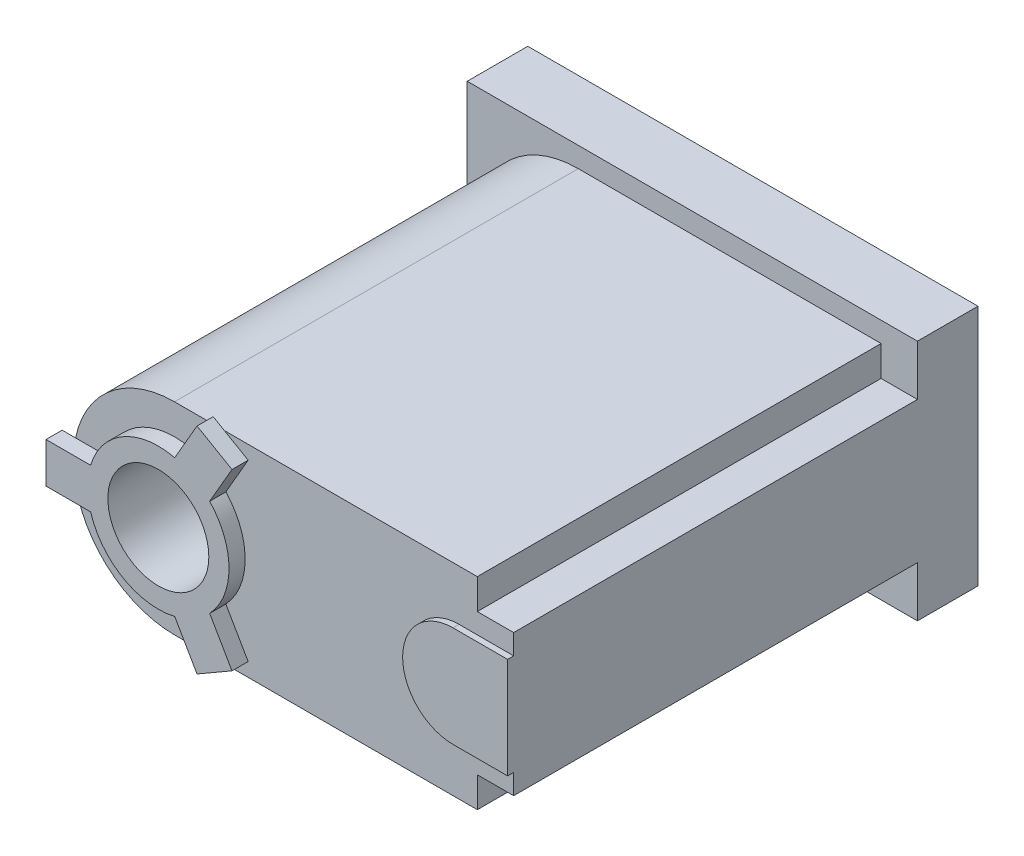
ISO-10303-21;
HEADER;
FILE_DESCRIPTION(('STEP AP214'),'2;1');
FILE_NAME('part.step','',(''),(''),'','','');
FILE_SCHEMA(('AUTOMOTIVE_DESIGN { 1 0 10303 214 1 1 1 1 }'));
ENDSEC;
DATA;
#1=APPLICATION_CONTEXT('core data for automotive mechanical design processes');
#2=APPLICATION_PROTOCOL_DEFINITION('international standard','automotive_design',2000,#1);
#3=PRODUCT_CONTEXT('',#1,'mechanical');
#4=PRODUCT('Part','Part','',(#3));
#5=PRODUCT_RELATED_PRODUCT_CATEGORY('part','',(#4));
#6=PRODUCT_DEFINITION_FORMATION('','',#4);
#7=PRODUCT_DEFINITION_CONTEXT('part definition',#1,'design');
#8=PRODUCT_DEFINITION('design','',#6,#7);
#9=PRODUCT_DEFINITION_SHAPE('','',#8);
#10=(LENGTH_UNIT() NAMED_UNIT(*) SI_UNIT(.MILLI.,.METRE.));
#11=(NAMED_UNIT(*) PLANE_ANGLE_UNIT() SI_UNIT($,.RADIAN.));
#12=(NAMED_UNIT(*) SI_UNIT($,.STERADIAN.) SOLID_ANGLE_UNIT());
#13=UNCERTAINTY_MEASURE_WITH_UNIT(LENGTH_MEASURE(1.E-05),#10,'distance_accuracy_value','');
#14=(GEOMETRIC_REPRESENTATION_CONTEXT(3) GLOBAL_UNCERTAINTY_ASSIGNED_CONTEXT((#13)) GLOBAL_UNIT_ASSIGNED_CONTEXT((#10,
#11,#12)) REPRESENTATION_CONTEXT('',''));
#15=CARTESIAN_POINT('',(0.,0.,0.));
#16=DIRECTION('',(0.,0.,1.));
#17=DIRECTION('',(1.,0.,0.));
#18=AXIS2_PLACEMENT_3D('',#15,#16,#17);
#19=CARTESIAN_POINT('',(0.,0.,230.));
#20=DIRECTION('',(0.,0.,1.));
#21=DIRECTION('',(1.,0.,0.));
#22=AXIS2_PLACEMENT_3D('',#19,#20,#21);
#23=PLANE('',#22);
#24=CARTESIAN_POINT('',(0.,0.,230.));
#25=DIRECTION('',(0.,0.,1.));
#26=DIRECTION('',(1.,0.,0.));
#27=AXIS2_PLACEMENT_3D('',#24,#25,#26);
#28=CIRCLE('',#27,35.);
#29=CARTESIAN_POINT('',(-33.5410196624969,-10.,230.));
#30=VERTEX_POINT('',#29);
#31=CARTESIAN_POINT('',(8.11025579340374,-34.0473750965557,230.));
#32=VERTEX_POINT('',#31);
#33=EDGE_CURVE('E48',#30,#32,#28,.T.);
#34=ORIENTED_EDGE('',*,*,#33,.F.);
#35=DIRECTION('',(1.,0.,0.));
#36=VECTOR('',#35,1.);
#37=CARTESIAN_POINT('',(-55.6463596710765,-10.,230.));
#38=LINE('',#37,#36);
#39=CARTESIAN_POINT('',(-48.9897948556636,-10.,230.));
#40=VERTEX_POINT('',#39);
#41=EDGE_CURVE('E447',#40,#30,#38,.T.);
#42=ORIENTED_EDGE('',*,*,#41,.F.);
#43=CARTESIAN_POINT('',(0.,0.,230.));
#44=DIRECTION('',(0.,0.,1.));
#45=DIRECTION('',(1.,0.,0.));
#46=AXIS2_PLACEMENT_3D('',#43,#44,#45);
#47=CIRCLE('',#46,50.);
#48=CARTESIAN_POINT('',(0.,-50.,230.));
#49=VERTEX_POINT('',#48);
#50=EDGE_CURVE('E392',#40,#49,#47,.T.);
#51=ORIENTED_EDGE('',*,*,#50,.T.);
#52=DIRECTION('',(1.,0.,0.));
#53=VECTOR('',#52,1.);
#54=CARTESIAN_POINT('',(150.,-50.,230.));
#55=LINE('',#54,#53);
#56=CARTESIAN_POINT('',(17.3205080756882,-50.,230.));
#57=VERTEX_POINT('',#56);
#58=EDGE_CURVE('E393',#49,#57,#55,.T.);
#59=ORIENTED_EDGE('',*,*,#58,.T.);
#60=DIRECTION('',(0.499999999999992,-0.866025403784443,0.));
#61=VECTOR('',#60,1.);
#62=CARTESIAN_POINT('',(19.1629257976934,-53.1911611032783,230.));
#63=LINE('',#62,#61);
#64=EDGE_CURVE('E53',#32,#57,#63,.T.);
#65=ORIENTED_EDGE('',*,*,#64,.F.);
#66=EDGE_LOOP('',(#34,#42,#51,#59,#65));
#67=FACE_BOUND('',#66,.T.);
#68=ADVANCED_FACE('F31',(#67),#23,.T.);
#69=DIRECTION('',(-0.499999999999992,0.866025403784443,0.));
#70=VECTOR('',#69,1.);
#71=CARTESIAN_POINT('',(36.4834338733823,-43.1911611032785,230.));
#72=LINE('',#71,#70);
#73=CARTESIAN_POINT('',(36.4834338733823,-43.1911611032785,230.));
#74=VERTEX_POINT('',#73);
#75=CARTESIAN_POINT('',(25.4307638690926,-24.0473750965559,230.));
#76=VERTEX_POINT('',#75);
#77=EDGE_CURVE('E463',#74,#76,#72,.T.);
#78=ORIENTED_EDGE('',*,*,#77,.F.);
#79=DIRECTION('',(0.866025403784443,0.499999999999992,0.));
#80=VECTOR('',#79,1.);
#81=CARTESIAN_POINT('',(19.1629257976934,-53.1911611032783,230.));
#82=LINE('',#81,#80);
#83=CARTESIAN_POINT('',(24.6901789637092,-50.,230.));
#84=VERTEX_POINT('',#83);
#85=EDGE_CURVE('E459',#84,#74,#82,.T.);
#86=ORIENTED_EDGE('',*,*,#85,.F.);
#87=CARTESIAN_POINT('',(150.,-50.,230.));
#88=VERTEX_POINT('',#87);
#89=EDGE_CURVE('E391',#84,#88,#55,.T.);
#90=ORIENTED_EDGE('',*,*,#89,.T.);
#91=DIRECTION('',(0.,1.,0.));
#92=VECTOR('',#91,1.);
#93=CARTESIAN_POINT('',(150.,50.,230.));
#94=LINE('',#93,#92);
#95=CARTESIAN_POINT('',(150.,-35.,230.));
#96=VERTEX_POINT('',#95);
#97=EDGE_CURVE('E404',#88,#96,#94,.T.);
#98=ORIENTED_EDGE('',*,*,#97,.T.);
#99=DIRECTION('',(-1.,0.,0.));
#100=VECTOR('',#99,1.);
#101=CARTESIAN_POINT('',(168.,-35.,230.));
#102=LINE('',#101,#100);
#103=CARTESIAN_POINT('',(168.,-35.,230.));
#104=VERTEX_POINT('',#103);
#105=EDGE_CURVE('E382',#104,#96,#102,.T.);
#106=ORIENTED_EDGE('',*,*,#105,.F.);
#107=DIRECTION('',(0.,-1.,0.));
#108=VECTOR('',#107,1.);
#109=CARTESIAN_POINT('',(168.,35.,230.));
#110=LINE('',#109,#108);
#111=CARTESIAN_POINT('',(168.,-25.,230.));
#112=VERTEX_POINT('',#111);
#113=EDGE_CURVE('E370',#112,#104,#110,.T.);
#114=ORIENTED_EDGE('',*,*,#113,.F.);
#115=DIRECTION('',(1.,0.,0.));
#116=VECTOR('',#115,1.);
#117=CARTESIAN_POINT('',(168.,-25.,230.));
#118=LINE('',#117,#116);
#119=CARTESIAN_POINT('',(141.,-25.,230.));
#120=VERTEX_POINT('',#119);
#121=EDGE_CURVE('E280',#120,#112,#118,.T.);
#122=ORIENTED_EDGE('',*,*,#121,.F.);
#123=CARTESIAN_POINT('',(141.,0.,230.));
#124=DIRECTION('',(0.,0.,1.));
#125=DIRECTION('',(1.,0.,0.));
#126=AXIS2_PLACEMENT_3D('',#123,#124,#125);
#127=CIRCLE('',#126,25.);
#128=CARTESIAN_POINT('',(141.,24.9999999999999,230.));
#129=VERTEX_POINT('',#128);
#130=EDGE_CURVE('E287',#129,#120,#127,.T.);
#131=ORIENTED_EDGE('',*,*,#130,.F.);
#132=DIRECTION('',(-1.,0.,0.));
#133=VECTOR('',#132,1.);
#134=CARTESIAN_POINT('',(168.,24.9999999999999,230.));
#135=LINE('',#134,#133);
#136=CARTESIAN_POINT('',(168.,24.9999999999999,230.));
#137=VERTEX_POINT('',#136);
#138=EDGE_CURVE('E275',#137,#129,#135,.T.);
#139=ORIENTED_EDGE('',*,*,#138,.F.);
#140=CARTESIAN_POINT('',(168.,35.,230.));
#141=VERTEX_POINT('',#140);
#142=EDGE_CURVE('E379',#141,#137,#110,.T.);
#143=ORIENTED_EDGE('',*,*,#142,.F.);
#144=DIRECTION('',(-1.,0.,0.));
#145=VECTOR('',#144,1.);
#146=CARTESIAN_POINT('',(168.,35.,230.));
#147=LINE('',#146,#145);
#148=CARTESIAN_POINT('',(150.,35.,230.));
#149=VERTEX_POINT('',#148);
#150=EDGE_CURVE('E584',#141,#149,#147,.T.);
#151=ORIENTED_EDGE('',*,*,#150,.T.);
#152=CARTESIAN_POINT('',(150.,50.,230.));
#153=VERTEX_POINT('',#152);
#154=EDGE_CURVE('E395',#149,#153,#94,.T.);
#155=ORIENTED_EDGE('',*,*,#154,.T.);
#156=DIRECTION('',(-1.,0.,0.));
#157=VECTOR('',#156,1.);
#158=CARTESIAN_POINT('',(0.,50.,230.));
#159=LINE('',#158,#157);
#160=CARTESIAN_POINT('',(24.6901789637093,50.,230.));
#161=VERTEX_POINT('',#160);
#162=EDGE_CURVE('E398',#153,#161,#159,.T.);
#163=ORIENTED_EDGE('',*,*,#162,.T.);
#164=DIRECTION('',(-0.866025403784436,0.500000000000004,0.));
#165=VECTOR('',#164,1.);
#166=CARTESIAN_POINT('',(36.4834338733829,43.191161103278,230.));
#167=LINE('',#166,#165);
#168=CARTESIAN_POINT('',(36.4834338733829,43.191161103278,230.));
#169=VERTEX_POINT('',#168);
#170=EDGE_CURVE('E473',#169,#161,#167,.T.);
#171=ORIENTED_EDGE('',*,*,#170,.F.);
#172=DIRECTION('',(0.500000000000004,0.866025403784436,0.));
#173=VECTOR('',#172,1.);
#174=CARTESIAN_POINT('',(36.4834338733829,43.191161103278,230.));
#175=LINE('',#174,#173);
#176=CARTESIAN_POINT('',(25.4307638690929,24.0473750965555,230.));
#177=VERTEX_POINT('',#176);
#178=EDGE_CURVE('E469',#177,#169,#175,.T.);
#179=ORIENTED_EDGE('',*,*,#178,.F.);
#180=CARTESIAN_POINT('',(0.,0.,230.));
#181=DIRECTION('',(0.,0.,1.));
#182=DIRECTION('',(1.,0.,0.));
#183=AXIS2_PLACEMENT_3D('',#180,#181,#182);
#184=CIRCLE('',#183,35.);
#185=EDGE_CURVE('E466',#76,#177,#184,.T.);
#186=ORIENTED_EDGE('',*,*,#185,.F.);
#187=EDGE_LOOP('',(#78,#86,#90,#98,#106,#114,#122,#131,#139,#143,#151,#155,#163,#171,#179,#186));
#188=FACE_BOUND('',#187,.T.);
#189=ADVANCED_FACE('F538',(#188),#23,.T.);
#190=CARTESIAN_POINT('',(0.,50.,230.));
#191=VERTEX_POINT('',#190);
#192=CARTESIAN_POINT('',(-48.9897948556636,10.,230.));
#193=VERTEX_POINT('',#192);
#194=EDGE_CURVE('E388',#191,#193,#47,.T.);
#195=ORIENTED_EDGE('',*,*,#194,.T.);
#196=DIRECTION('',(-1.,0.,0.));
#197=VECTOR('',#196,1.);
#198=CARTESIAN_POINT('',(-55.6463596710765,10.,230.));
#199=LINE('',#198,#197);
#200=CARTESIAN_POINT('',(-33.5410196624969,10.,230.));
#201=VERTEX_POINT('',#200);
#202=EDGE_CURVE('E526',#201,#193,#199,.T.);
#203=ORIENTED_EDGE('',*,*,#202,.F.);
#204=CARTESIAN_POINT('',(0.,0.,230.));
#205=DIRECTION('',(0.,0.,1.));
#206=DIRECTION('',(1.,0.,0.));
#207=AXIS2_PLACEMENT_3D('',#204,#205,#206);
#208=CIRCLE('',#207,35.);
#209=CARTESIAN_POINT('',(8.1102557934042,34.0473750965556,230.));
#210=VERTEX_POINT('',#209);
#211=EDGE_CURVE('E260',#210,#201,#208,.T.);
#212=ORIENTED_EDGE('',*,*,#211,.F.);
#213=DIRECTION('',(-0.500000000000004,-0.866025403784436,0.));
#214=VECTOR('',#213,1.);
#215=CARTESIAN_POINT('',(19.1629257976941,53.1911611032781,230.));
#216=LINE('',#215,#214);
#217=CARTESIAN_POINT('',(17.320508075689,50.,230.));
#218=VERTEX_POINT('',#217);
#219=EDGE_CURVE('E430',#218,#210,#216,.T.);
#220=ORIENTED_EDGE('',*,*,#219,.F.);
#221=EDGE_CURVE('E407',#218,#191,#159,.T.);
#222=ORIENTED_EDGE('',*,*,#221,.T.);
#223=EDGE_LOOP('',(#195,#203,#212,#220,#222));
#224=FACE_BOUND('',#223,.T.);
#225=ADVANCED_FACE('F427',(#224),#23,.T.);
#226=CARTESIAN_POINT('',(150.,50.,230.));
#227=DIRECTION('',(-1.,0.,0.));
#228=DIRECTION('',(0.,0.,1.));
#229=AXIS2_PLACEMENT_3D('',#226,#227,#228);
#230=PLANE('',#229);
#231=DIRECTION('',(0.,0.,-1.));
#232=VECTOR('',#231,1.);
#233=CARTESIAN_POINT('',(150.,-50.,230.));
#234=LINE('',#233,#232);
#235=CARTESIAN_POINT('',(150.,-50.,30.));
#236=VERTEX_POINT('',#235);
#237=EDGE_CURVE('E410',#88,#236,#234,.T.);
#238=ORIENTED_EDGE('',*,*,#237,.T.);
#239=DIRECTION('',(0.,1.,0.));
#240=VECTOR('',#239,1.);
#241=CARTESIAN_POINT('',(150.,50.,30.));
#242=LINE('',#241,#240);
#243=CARTESIAN_POINT('',(150.,-35.,30.));
#244=VERTEX_POINT('',#243);
#245=EDGE_CURVE('E357',#236,#244,#242,.T.);
#246=ORIENTED_EDGE('',*,*,#245,.T.);
#247=DIRECTION('',(0.,0.,-1.));
#248=VECTOR('',#247,1.);
#249=CARTESIAN_POINT('',(150.,-35.,230.));
#250=LINE('',#249,#248);
#251=EDGE_CURVE('E360',#96,#244,#250,.T.);
#252=ORIENTED_EDGE('',*,*,#251,.F.);
#253=ORIENTED_EDGE('',*,*,#97,.F.);
#254=EDGE_LOOP('',(#238,#246,#252,#253));
#255=FACE_BOUND('',#254,.T.);
#256=ADVANCED_FACE('F546',(#255),#230,.F.);
#257=DIRECTION('',(0.,0.,1.));
#258=VECTOR('',#257,1.);
#259=CARTESIAN_POINT('',(150.,35.,0.));
#260=LINE('',#259,#258);
#261=CARTESIAN_POINT('',(150.,35.,30.));
#262=VERTEX_POINT('',#261);
#263=EDGE_CURVE('E366',#262,#149,#260,.T.);
#264=ORIENTED_EDGE('',*,*,#263,.F.);
#265=DIRECTION('',(0.,1.,0.));
#266=VECTOR('',#265,1.);
#267=CARTESIAN_POINT('',(150.,50.,30.));
#268=LINE('',#267,#266);
#269=CARTESIAN_POINT('',(150.,50.,30.));
#270=VERTEX_POINT('',#269);
#271=EDGE_CURVE('E349',#262,#270,#268,.T.);
#272=ORIENTED_EDGE('',*,*,#271,.T.);
#273=DIRECTION('',(0.,0.,-1.));
#274=VECTOR('',#273,1.);
#275=CARTESIAN_POINT('',(150.,50.,230.));
#276=LINE('',#275,#274);
#277=EDGE_CURVE('E413',#153,#270,#276,.T.);
#278=ORIENTED_EDGE('',*,*,#277,.F.);
#279=ORIENTED_EDGE('',*,*,#154,.F.);
#280=EDGE_LOOP('',(#264,#272,#278,#279));
#281=FACE_BOUND('',#280,.T.);
#282=ADVANCED_FACE('F550',(#281),#230,.F.);
#283=CARTESIAN_POINT('',(0.,0.,0.));
#284=DIRECTION('',(0.,0.,1.));
#285=DIRECTION('',(1.,0.,0.));
#286=AXIS2_PLACEMENT_3D('',#283,#284,#285);
#287=PLANE('',#286);
#288=DIRECTION('',(0.,1.,0.));
#289=VECTOR('',#288,1.);
#290=CARTESIAN_POINT('',(168.,-35.,0.));
#291=LINE('',#290,#289);
#292=CARTESIAN_POINT('',(168.,-60.,0.));
#293=VERTEX_POINT('',#292);
#294=CARTESIAN_POINT('',(168.,60.,0.));
#295=VERTEX_POINT('',#294);
#296=EDGE_CURVE('E365',#293,#295,#291,.T.);
#297=ORIENTED_EDGE('',*,*,#296,.F.);
#298=DIRECTION('',(-1.,0.,0.));
#299=VECTOR('',#298,1.);
#300=CARTESIAN_POINT('',(-55.,-60.,0.));
#301=LINE('',#300,#299);
#302=CARTESIAN_POINT('',(-55.,-60.,0.));
#303=VERTEX_POINT('',#302);
#304=EDGE_CURVE('E314',#293,#303,#301,.T.);
#305=ORIENTED_EDGE('',*,*,#304,.T.);
#306=DIRECTION('',(0.,1.,0.));
#307=VECTOR('',#306,1.);
#308=CARTESIAN_POINT('',(-55.,60.,0.));
#309=LINE('',#308,#307);
#310=CARTESIAN_POINT('',(-55.,60.,0.));
#311=VERTEX_POINT('',#310);
#312=EDGE_CURVE('E333',#303,#311,#309,.T.);
#313=ORIENTED_EDGE('',*,*,#312,.T.);
#314=DIRECTION('',(1.,0.,0.));
#315=VECTOR('',#314,1.);
#316=CARTESIAN_POINT('',(168.,60.,0.));
#317=LINE('',#316,#315);
#318=EDGE_CURVE('E320',#311,#295,#317,.T.);
#319=ORIENTED_EDGE('',*,*,#318,.T.);
#320=EDGE_LOOP('',(#297,#305,#313,#319));
#321=FACE_BOUND('',#320,.T.);
#322=ADVANCED_FACE('F556',(#321),#287,.F.);
#323=CARTESIAN_POINT('',(0.,0.,230.));
#324=DIRECTION('',(0.,0.,-1.));
#325=DIRECTION('',(-1.,0.,0.));
#326=AXIS2_PLACEMENT_3D('',#323,#324,#325);
#327=CYLINDRICAL_SURFACE('',#326,50.);
#328=DIRECTION('',(0.,0.,-1.));
#329=VECTOR('',#328,1.);
#330=CARTESIAN_POINT('',(0.,50.,230.));
#331=LINE('',#330,#329);
#332=CARTESIAN_POINT('',(0.,50.,30.));
#333=VERTEX_POINT('',#332);
#334=EDGE_CURVE('E415',#191,#333,#331,.T.);
#335=ORIENTED_EDGE('',*,*,#334,.T.);
#336=CARTESIAN_POINT('',(0.,0.,30.));
#337=DIRECTION('',(0.,0.,1.));
#338=DIRECTION('',(1.,0.,0.));
#339=AXIS2_PLACEMENT_3D('',#336,#337,#338);
#340=CIRCLE('',#339,50.);
#341=CARTESIAN_POINT('',(0.,-50.,30.));
#342=VERTEX_POINT('',#341);
#343=EDGE_CURVE('E353',#333,#342,#340,.T.);
#344=ORIENTED_EDGE('',*,*,#343,.T.);
#345=DIRECTION('',(0.,0.,-1.));
#346=VECTOR('',#345,1.);
#347=CARTESIAN_POINT('',(0.,-50.,230.));
#348=LINE('',#347,#346);
#349=EDGE_CURVE('E40',#49,#342,#348,.T.);
#350=ORIENTED_EDGE('',*,*,#349,.F.);
#351=ORIENTED_EDGE('',*,*,#50,.F.);
#352=CARTESIAN_POINT('',(0.,0.,230.));
#353=DIRECTION('',(0.,0.,1.));
#354=DIRECTION('',(1.,0.,0.));
#355=AXIS2_PLACEMENT_3D('',#352,#353,#354);
#356=CIRCLE('',#355,50.);
#357=EDGE_CURVE('E272',#193,#40,#356,.T.);
#358=ORIENTED_EDGE('',*,*,#357,.F.);
#359=ORIENTED_EDGE('',*,*,#194,.F.);
#360=EDGE_LOOP('',(#335,#344,#350,#351,#358,#359));
#361=FACE_BOUND('',#360,.T.);
#362=ADVANCED_FACE('F33',(#361),#327,.T.);
#363=CARTESIAN_POINT('',(150.,-50.,230.));
#364=DIRECTION('',(0.,1.,0.));
#365=DIRECTION('',(-1.,0.,0.));
#366=AXIS2_PLACEMENT_3D('',#363,#364,#365);
#367=PLANE('',#366);
#368=ORIENTED_EDGE('',*,*,#349,.T.);
#369=DIRECTION('',(1.,0.,0.));
#370=VECTOR('',#369,1.);
#371=CARTESIAN_POINT('',(150.,-50.,30.));
#372=LINE('',#371,#370);
#373=EDGE_CURVE('E355',#342,#236,#372,.T.);
#374=ORIENTED_EDGE('',*,*,#373,.T.);
#375=ORIENTED_EDGE('',*,*,#237,.F.);
#376=ORIENTED_EDGE('',*,*,#89,.F.);
#377=DIRECTION('',(1.,0.,0.));
#378=VECTOR('',#377,1.);
#379=CARTESIAN_POINT('',(150.,-50.,230.));
#380=LINE('',#379,#378);
#381=EDGE_CURVE('E264',#57,#84,#380,.T.);
#382=ORIENTED_EDGE('',*,*,#381,.F.);
#383=ORIENTED_EDGE('',*,*,#58,.F.);
#384=EDGE_LOOP('',(#368,#374,#375,#376,#382,#383));
#385=FACE_BOUND('',#384,.T.);
#386=ADVANCED_FACE('F559',(#385),#367,.F.);
#387=CARTESIAN_POINT('',(0.,50.,230.));
#388=DIRECTION('',(0.,-1.,0.));
#389=DIRECTION('',(1.,0.,0.));
#390=AXIS2_PLACEMENT_3D('',#387,#388,#389);
#391=PLANE('',#390);
#392=ORIENTED_EDGE('',*,*,#277,.T.);
#393=DIRECTION('',(-1.,0.,0.));
#394=VECTOR('',#393,1.);
#395=CARTESIAN_POINT('',(0.,50.,30.));
#396=LINE('',#395,#394);
#397=EDGE_CURVE('E351',#270,#333,#396,.T.);
#398=ORIENTED_EDGE('',*,*,#397,.T.);
#399=ORIENTED_EDGE('',*,*,#334,.F.);
#400=ORIENTED_EDGE('',*,*,#221,.F.);
#401=DIRECTION('',(-1.,0.,0.));
#402=VECTOR('',#401,1.);
#403=CARTESIAN_POINT('',(0.,50.,230.));
#404=LINE('',#403,#402);
#405=EDGE_CURVE('E261',#161,#218,#404,.T.);
#406=ORIENTED_EDGE('',*,*,#405,.F.);
#407=ORIENTED_EDGE('',*,*,#162,.F.);
#408=EDGE_LOOP('',(#392,#398,#399,#400,#406,#407));
#409=FACE_BOUND('',#408,.T.);
#410=ADVANCED_FACE('F432',(#409),#391,.F.);
#411=CARTESIAN_POINT('',(168.,-35.,230.));
#412=DIRECTION('',(0.,1.,0.));
#413=DIRECTION('',(0.,0.,1.));
#414=AXIS2_PLACEMENT_3D('',#411,#412,#413);
#415=PLANE('',#414);
#416=ORIENTED_EDGE('',*,*,#251,.T.);
#417=DIRECTION('',(1.,0.,0.));
#418=VECTOR('',#417,1.);
#419=CARTESIAN_POINT('',(168.,-35.,30.));
#420=LINE('',#419,#418);
#421=CARTESIAN_POINT('',(168.,-35.,30.));
#422=VERTEX_POINT('',#421);
#423=EDGE_CURVE('E359',#244,#422,#420,.T.);
#424=ORIENTED_EDGE('',*,*,#423,.T.);
#425=DIRECTION('',(0.,0.,-1.));
#426=VECTOR('',#425,1.);
#427=CARTESIAN_POINT('',(168.,-35.,230.));
#428=LINE('',#427,#426);
#429=EDGE_CURVE('E362',#104,#422,#428,.T.);
#430=ORIENTED_EDGE('',*,*,#429,.F.);
#431=ORIENTED_EDGE('',*,*,#105,.T.);
#432=EDGE_LOOP('',(#416,#424,#430,#431));
#433=FACE_BOUND('',#432,.T.);
#434=ADVANCED_FACE('F566',(#433),#415,.F.);
#435=CARTESIAN_POINT('',(168.,35.,0.));
#436=DIRECTION('',(0.,-1.,0.));
#437=DIRECTION('',(0.,0.,-1.));
#438=AXIS2_PLACEMENT_3D('',#435,#436,#437);
#439=PLANE('',#438);
#440=DIRECTION('',(0.,0.,1.));
#441=VECTOR('',#440,1.);
#442=CARTESIAN_POINT('',(168.,35.,0.));
#443=LINE('',#442,#441);
#444=CARTESIAN_POINT('',(168.,35.,30.));
#445=VERTEX_POINT('',#444);
#446=EDGE_CURVE('E368',#445,#141,#443,.T.);
#447=ORIENTED_EDGE('',*,*,#446,.F.);
#448=DIRECTION('',(-1.,0.,0.));
#449=VECTOR('',#448,1.);
#450=CARTESIAN_POINT('',(168.,35.,30.));
#451=LINE('',#450,#449);
#452=EDGE_CURVE('E341',#445,#262,#451,.T.);
#453=ORIENTED_EDGE('',*,*,#452,.T.);
#454=ORIENTED_EDGE('',*,*,#263,.T.);
#455=ORIENTED_EDGE('',*,*,#150,.F.);
#456=EDGE_LOOP('',(#447,#453,#454,#455));
#457=FACE_BOUND('',#456,.T.);
#458=ADVANCED_FACE('F629',(#457),#439,.F.);
#459=CARTESIAN_POINT('',(168.,-35.,0.));
#460=DIRECTION('',(1.,0.,0.));
#461=DIRECTION('',(0.,0.,-1.));
#462=AXIS2_PLACEMENT_3D('',#459,#460,#461);
#463=PLANE('',#462);
#464=ORIENTED_EDGE('',*,*,#429,.T.);
#465=DIRECTION('',(0.,-1.,0.));
#466=VECTOR('',#465,1.);
#467=CARTESIAN_POINT('',(168.,-60.,30.));
#468=LINE('',#467,#466);
#469=CARTESIAN_POINT('',(168.,-60.,30.));
#470=VERTEX_POINT('',#469);
#471=EDGE_CURVE('E326',#422,#470,#468,.T.);
#472=ORIENTED_EDGE('',*,*,#471,.T.);
#473=DIRECTION('',(0.,0.,-1.));
#474=VECTOR('',#473,1.);
#475=CARTESIAN_POINT('',(168.,-60.,30.));
#476=LINE('',#475,#474);
#477=EDGE_CURVE('E338',#470,#293,#476,.T.);
#478=ORIENTED_EDGE('',*,*,#477,.T.);
#479=ORIENTED_EDGE('',*,*,#296,.T.);
#480=DIRECTION('',(0.,0.,-1.));
#481=VECTOR('',#480,1.);
#482=CARTESIAN_POINT('',(168.,60.,30.));
#483=LINE('',#482,#481);
#484=CARTESIAN_POINT('',(168.,60.,30.));
#485=VERTEX_POINT('',#484);
#486=EDGE_CURVE('E342',#485,#295,#483,.T.);
#487=ORIENTED_EDGE('',*,*,#486,.F.);
#488=EDGE_CURVE('E327',#485,#445,#468,.T.);
#489=ORIENTED_EDGE('',*,*,#488,.T.);
#490=ORIENTED_EDGE('',*,*,#446,.T.);
#491=ORIENTED_EDGE('',*,*,#142,.T.);
#492=DIRECTION('',(0.,0.,-1.));
#493=VECTOR('',#492,1.);
#494=CARTESIAN_POINT('',(168.,24.9999999999999,233.));
#495=LINE('',#494,#493);
#496=CARTESIAN_POINT('',(168.,24.9999999999999,233.));
#497=VERTEX_POINT('',#496);
#498=EDGE_CURVE('E309',#497,#137,#495,.T.);
#499=ORIENTED_EDGE('',*,*,#498,.F.);
#500=DIRECTION('',(0.,1.,0.));
#501=VECTOR('',#500,1.);
#502=CARTESIAN_POINT('',(168.,24.9999999999999,233.));
#503=LINE('',#502,#501);
#504=CARTESIAN_POINT('',(168.,-25.,233.));
#505=VERTEX_POINT('',#504);
#506=EDGE_CURVE('E276',#505,#497,#503,.T.);
#507=ORIENTED_EDGE('',*,*,#506,.F.);
#508=DIRECTION('',(0.,0.,-1.));
#509=VECTOR('',#508,1.);
#510=CARTESIAN_POINT('',(168.,-25.,233.));
#511=LINE('',#510,#509);
#512=EDGE_CURVE('E286',#505,#112,#511,.T.);
#513=ORIENTED_EDGE('',*,*,#512,.T.);
#514=ORIENTED_EDGE('',*,*,#113,.T.);
#515=EDGE_LOOP('',(#464,#472,#478,#479,#487,#489,#490,#491,#499,#507,#513,#514));
#516=FACE_BOUND('',#515,.T.);
#517=ADVANCED_FACE('F630',(#516),#463,.T.);
#518=CARTESIAN_POINT('',(-55.,60.,30.));
#519=DIRECTION('',(-1.,0.,0.));
#520=DIRECTION('',(0.,0.,1.));
#521=AXIS2_PLACEMENT_3D('',#518,#519,#520);
#522=PLANE('',#521);
#523=ORIENTED_EDGE('',*,*,#312,.F.);
#524=DIRECTION('',(0.,0.,-1.));
#525=VECTOR('',#524,1.);
#526=CARTESIAN_POINT('',(-55.,-60.,30.));
#527=LINE('',#526,#525);
#528=CARTESIAN_POINT('',(-55.,-60.,30.));
#529=VERTEX_POINT('',#528);
#530=EDGE_CURVE('E330',#529,#303,#527,.T.);
#531=ORIENTED_EDGE('',*,*,#530,.F.);
#532=DIRECTION('',(0.,1.,0.));
#533=VECTOR('',#532,1.);
#534=CARTESIAN_POINT('',(-55.,60.,30.));
#535=LINE('',#534,#533);
#536=CARTESIAN_POINT('',(-55.,60.,30.));
#537=VERTEX_POINT('',#536);
#538=EDGE_CURVE('E319',#529,#537,#535,.T.);
#539=ORIENTED_EDGE('',*,*,#538,.T.);
#540=DIRECTION('',(0.,0.,-1.));
#541=VECTOR('',#540,1.);
#542=CARTESIAN_POINT('',(-55.,60.,30.));
#543=LINE('',#542,#541);
#544=EDGE_CURVE('E345',#537,#311,#543,.T.);
#545=ORIENTED_EDGE('',*,*,#544,.T.);
#546=EDGE_LOOP('',(#523,#531,#539,#545));
#547=FACE_BOUND('',#546,.T.);
#548=ADVANCED_FACE('F638',(#547),#522,.T.);
#549=CARTESIAN_POINT('',(168.,60.,30.));
#550=DIRECTION('',(0.,1.,0.));
#551=DIRECTION('',(0.,0.,1.));
#552=AXIS2_PLACEMENT_3D('',#549,#550,#551);
#553=PLANE('',#552);
#554=ORIENTED_EDGE('',*,*,#318,.F.);
#555=ORIENTED_EDGE('',*,*,#544,.F.);
#556=DIRECTION('',(1.,0.,0.));
#557=VECTOR('',#556,1.);
#558=CARTESIAN_POINT('',(168.,60.,30.));
#559=LINE('',#558,#557);
#560=EDGE_CURVE('E323',#537,#485,#559,.T.);
#561=ORIENTED_EDGE('',*,*,#560,.T.);
#562=ORIENTED_EDGE('',*,*,#486,.T.);
#563=EDGE_LOOP('',(#554,#555,#561,#562));
#564=FACE_BOUND('',#563,.T.);
#565=ADVANCED_FACE('F668',(#564),#553,.T.);
#566=CARTESIAN_POINT('',(-55.,-60.,30.));
#567=DIRECTION('',(0.,-1.,0.));
#568=DIRECTION('',(1.,0.,0.));
#569=AXIS2_PLACEMENT_3D('',#566,#567,#568);
#570=PLANE('',#569);
#571=ORIENTED_EDGE('',*,*,#304,.F.);
#572=ORIENTED_EDGE('',*,*,#477,.F.);
#573=DIRECTION('',(-1.,0.,0.));
#574=VECTOR('',#573,1.);
#575=CARTESIAN_POINT('',(-55.,-60.,30.));
#576=LINE('',#575,#574);
#577=EDGE_CURVE('E316',#470,#529,#576,.T.);
#578=ORIENTED_EDGE('',*,*,#577,.T.);
#579=ORIENTED_EDGE('',*,*,#530,.T.);
#580=EDGE_LOOP('',(#571,#572,#578,#579));
#581=FACE_BOUND('',#580,.T.);
#582=ADVANCED_FACE('F642',(#581),#570,.T.);
#583=CARTESIAN_POINT('',(168.,-60.,30.));
#584=DIRECTION('',(0.,0.,1.));
#585=DIRECTION('',(1.,0.,0.));
#586=AXIS2_PLACEMENT_3D('',#583,#584,#585);
#587=PLANE('',#586);
#588=ORIENTED_EDGE('',*,*,#423,.F.);
#589=ORIENTED_EDGE('',*,*,#245,.F.);
#590=ORIENTED_EDGE('',*,*,#373,.F.);
#591=ORIENTED_EDGE('',*,*,#343,.F.);
#592=ORIENTED_EDGE('',*,*,#397,.F.);
#593=ORIENTED_EDGE('',*,*,#271,.F.);
#594=ORIENTED_EDGE('',*,*,#452,.F.);
#595=ORIENTED_EDGE('',*,*,#488,.F.);
#596=ORIENTED_EDGE('',*,*,#560,.F.);
#597=ORIENTED_EDGE('',*,*,#538,.F.);
#598=ORIENTED_EDGE('',*,*,#577,.F.);
#599=ORIENTED_EDGE('',*,*,#471,.F.);
#600=EDGE_LOOP('',(#588,#589,#590,#591,#592,#593,#594,#595,#596,#597,#598,#599));
#601=FACE_BOUND('',#600,.T.);
#602=ADVANCED_FACE('F573',(#601),#587,.T.);
#603=CARTESIAN_POINT('',(168.,24.9999999999999,233.));
#604=DIRECTION('',(0.,-1.,0.));
#605=DIRECTION('',(1.,0.,0.));
#606=AXIS2_PLACEMENT_3D('',#603,#604,#605);
#607=PLANE('',#606);
#608=ORIENTED_EDGE('',*,*,#138,.T.);
#609=DIRECTION('',(0.,0.,-1.));
#610=VECTOR('',#609,1.);
#611=CARTESIAN_POINT('',(141.,24.9999999999999,233.));
#612=LINE('',#611,#610);
#613=CARTESIAN_POINT('',(141.,24.9999999999999,233.));
#614=VERTEX_POINT('',#613);
#615=EDGE_CURVE('E304',#614,#129,#612,.T.);
#616=ORIENTED_EDGE('',*,*,#615,.F.);
#617=DIRECTION('',(-1.,0.,0.));
#618=VECTOR('',#617,1.);
#619=CARTESIAN_POINT('',(168.,24.9999999999999,233.));
#620=LINE('',#619,#618);
#621=EDGE_CURVE('E279',#497,#614,#620,.T.);
#622=ORIENTED_EDGE('',*,*,#621,.F.);
#623=ORIENTED_EDGE('',*,*,#498,.T.);
#624=EDGE_LOOP('',(#608,#616,#622,#623));
#625=FACE_BOUND('',#624,.T.);
#626=ADVANCED_FACE('F651',(#625),#607,.F.);
#627=CARTESIAN_POINT('',(141.,0.,233.));
#628=DIRECTION('',(0.,0.,-1.));
#629=DIRECTION('',(-1.,0.,0.));
#630=AXIS2_PLACEMENT_3D('',#627,#628,#629);
#631=CYLINDRICAL_SURFACE('',#630,25.);
#632=ORIENTED_EDGE('',*,*,#130,.T.);
#633=DIRECTION('',(0.,0.,-1.));
#634=VECTOR('',#633,1.);
#635=CARTESIAN_POINT('',(141.,-25.,233.));
#636=LINE('',#635,#634);
#637=CARTESIAN_POINT('',(141.,-25.,233.));
#638=VERTEX_POINT('',#637);
#639=EDGE_CURVE('E292',#638,#120,#636,.T.);
#640=ORIENTED_EDGE('',*,*,#639,.F.);
#641=CARTESIAN_POINT('',(141.,0.,233.));
#642=DIRECTION('',(0.,0.,1.));
#643=DIRECTION('',(1.,0.,0.));
#644=AXIS2_PLACEMENT_3D('',#641,#642,#643);
#645=CIRCLE('',#644,25.);
#646=EDGE_CURVE('E282',#614,#638,#645,.T.);
#647=ORIENTED_EDGE('',*,*,#646,.F.);
#648=ORIENTED_EDGE('',*,*,#615,.T.);
#649=EDGE_LOOP('',(#632,#640,#647,#648));
#650=FACE_BOUND('',#649,.T.);
#651=ADVANCED_FACE('F648',(#650),#631,.T.);
#652=CARTESIAN_POINT('',(168.,-25.,233.));
#653=DIRECTION('',(0.,1.,0.));
#654=DIRECTION('',(-1.,0.,0.));
#655=AXIS2_PLACEMENT_3D('',#652,#653,#654);
#656=PLANE('',#655);
#657=ORIENTED_EDGE('',*,*,#121,.T.);
#658=ORIENTED_EDGE('',*,*,#512,.F.);
#659=DIRECTION('',(1.,0.,0.));
#660=VECTOR('',#659,1.);
#661=CARTESIAN_POINT('',(168.,-25.,233.));
#662=LINE('',#661,#660);
#663=EDGE_CURVE('E284',#638,#505,#662,.T.);
#664=ORIENTED_EDGE('',*,*,#663,.F.);
#665=ORIENTED_EDGE('',*,*,#639,.T.);
#666=EDGE_LOOP('',(#657,#658,#664,#665));
#667=FACE_BOUND('',#666,.T.);
#668=ADVANCED_FACE('F645',(#667),#656,.F.);
#669=CARTESIAN_POINT('',(141.,0.,233.));
#670=DIRECTION('',(0.,0.,1.));
#671=DIRECTION('',(1.,0.,0.));
#672=AXIS2_PLACEMENT_3D('',#669,#670,#671);
#673=PLANE('',#672);
#674=ORIENTED_EDGE('',*,*,#506,.T.);
#675=ORIENTED_EDGE('',*,*,#621,.T.);
#676=ORIENTED_EDGE('',*,*,#646,.T.);
#677=ORIENTED_EDGE('',*,*,#663,.T.);
#678=EDGE_LOOP('',(#674,#675,#676,#677));
#679=FACE_BOUND('',#678,.T.);
#680=ADVANCED_FACE('F647',(#679),#673,.T.);
#681=CARTESIAN_POINT('',(0.,0.,230.));
#682=DIRECTION('',(0.,0.,1.));
#683=DIRECTION('',(1.,0.,0.));
#684=AXIS2_PLACEMENT_3D('',#681,#682,#683);
#685=PLANE('',#684);
#686=CARTESIAN_POINT('',(-55.6463596710765,10.,230.));
#687=VERTEX_POINT('',#686);
#688=EDGE_CURVE('E442',#193,#687,#199,.T.);
#689=ORIENTED_EDGE('',*,*,#688,.F.);
#690=ORIENTED_EDGE('',*,*,#357,.T.);
#691=CARTESIAN_POINT('',(-55.6463596710765,-10.,230.));
#692=VERTEX_POINT('',#691);
#693=EDGE_CURVE('E441',#692,#40,#38,.T.);
#694=ORIENTED_EDGE('',*,*,#693,.F.);
#695=DIRECTION('',(0.,-1.,0.));
#696=VECTOR('',#695,1.);
#697=CARTESIAN_POINT('',(-55.6463596710765,10.,230.));
#698=LINE('',#697,#696);
#699=EDGE_CURVE('E454',#687,#692,#698,.T.);
#700=ORIENTED_EDGE('',*,*,#699,.F.);
#701=EDGE_LOOP('',(#689,#690,#694,#700));
#702=FACE_BOUND('',#701,.T.);
#703=ADVANCED_FACE('F439',(#702),#685,.F.);
#704=CARTESIAN_POINT('',(19.1629257976934,-53.1911611032783,230.));
#705=VERTEX_POINT('',#704);
#706=EDGE_CURVE('E452',#57,#705,#63,.T.);
#707=ORIENTED_EDGE('',*,*,#706,.F.);
#708=ORIENTED_EDGE('',*,*,#381,.T.);
#709=EDGE_CURVE('E460',#705,#84,#82,.T.);
#710=ORIENTED_EDGE('',*,*,#709,.F.);
#711=EDGE_LOOP('',(#707,#708,#710));
#712=FACE_BOUND('',#711,.T.);
#713=ADVANCED_FACE('F591',(#712),#685,.F.);
#714=CARTESIAN_POINT('',(19.1629257976941,53.1911611032781,230.));
#715=VERTEX_POINT('',#714);
#716=EDGE_CURVE('E472',#161,#715,#167,.T.);
#717=ORIENTED_EDGE('',*,*,#716,.F.);
#718=ORIENTED_EDGE('',*,*,#405,.T.);
#719=EDGE_CURVE('E257',#715,#218,#216,.T.);
#720=ORIENTED_EDGE('',*,*,#719,.F.);
#721=EDGE_LOOP('',(#717,#718,#720));
#722=FACE_BOUND('',#721,.T.);
#723=ADVANCED_FACE('F621',(#722),#685,.F.);
#724=CARTESIAN_POINT('',(0.,0.,238.));
#725=DIRECTION('',(0.,0.,1.));
#726=DIRECTION('',(1.,0.,0.));
#727=AXIS2_PLACEMENT_3D('',#724,#725,#726);
#728=PLANE('',#727);
#729=CARTESIAN_POINT('',(0.,0.,238.));
#730=DIRECTION('',(0.,0.,1.));
#731=DIRECTION('',(1.,0.,0.));
#732=AXIS2_PLACEMENT_3D('',#729,#730,#731);
#733=CIRCLE('',#732,35.);
#734=CARTESIAN_POINT('',(8.1102557934042,34.0473750965556,238.));
#735=VERTEX_POINT('',#734);
#736=CARTESIAN_POINT('',(-33.5410196624969,10.,238.));
#737=VERTEX_POINT('',#736);
#738=EDGE_CURVE('E247',#735,#737,#733,.T.);
#739=ORIENTED_EDGE('',*,*,#738,.T.);
#740=DIRECTION('',(-1.,0.,0.));
#741=VECTOR('',#740,1.);
#742=CARTESIAN_POINT('',(-55.6463596710765,10.,238.));
#743=LINE('',#742,#741);
#744=CARTESIAN_POINT('',(-55.6463596710765,10.,238.));
#745=VERTEX_POINT('',#744);
#746=EDGE_CURVE('E235',#737,#745,#743,.T.);
#747=ORIENTED_EDGE('',*,*,#746,.T.);
#748=DIRECTION('',(0.,-1.,0.));
#749=VECTOR('',#748,1.);
#750=CARTESIAN_POINT('',(-55.6463596710765,10.,238.));
#751=LINE('',#750,#749);
#752=CARTESIAN_POINT('',(-55.6463596710765,-10.,238.));
#753=VERTEX_POINT('',#752);
#754=EDGE_CURVE('E246',#745,#753,#751,.T.);
#755=ORIENTED_EDGE('',*,*,#754,.T.);
#756=DIRECTION('',(1.,0.,0.));
#757=VECTOR('',#756,1.);
#758=CARTESIAN_POINT('',(-55.6463596710765,-10.,238.));
#759=LINE('',#758,#757);
#760=CARTESIAN_POINT('',(-33.5410196624969,-10.,238.));
#761=VERTEX_POINT('',#760);
#762=EDGE_CURVE('E507',#753,#761,#759,.T.);
#763=ORIENTED_EDGE('',*,*,#762,.T.);
#764=CARTESIAN_POINT('',(0.,0.,238.));
#765=DIRECTION('',(0.,0.,1.));
#766=DIRECTION('',(1.,0.,0.));
#767=AXIS2_PLACEMENT_3D('',#764,#765,#766);
#768=CIRCLE('',#767,35.);
#769=CARTESIAN_POINT('',(8.11025579340373,-34.0473750965557,238.));
#770=VERTEX_POINT('',#769);
#771=EDGE_CURVE('E506',#761,#770,#768,.T.);
#772=ORIENTED_EDGE('',*,*,#771,.T.);
#773=DIRECTION('',(0.499999999999992,-0.866025403784443,0.));
#774=VECTOR('',#773,1.);
#775=CARTESIAN_POINT('',(19.1629257976934,-53.1911611032783,238.));
#776=LINE('',#775,#774);
#777=CARTESIAN_POINT('',(19.1629257976934,-53.1911611032783,238.));
#778=VERTEX_POINT('',#777);
#779=EDGE_CURVE('E509',#770,#778,#776,.T.);
#780=ORIENTED_EDGE('',*,*,#779,.T.);
#781=DIRECTION('',(0.866025403784443,0.499999999999992,0.));
#782=VECTOR('',#781,1.);
#783=CARTESIAN_POINT('',(19.1629257976934,-53.1911611032783,238.));
#784=LINE('',#783,#782);
#785=CARTESIAN_POINT('',(36.4834338733823,-43.1911611032785,238.));
#786=VERTEX_POINT('',#785);
#787=EDGE_CURVE('E514',#778,#786,#784,.T.);
#788=ORIENTED_EDGE('',*,*,#787,.T.);
#789=DIRECTION('',(-0.499999999999992,0.866025403784443,0.));
#790=VECTOR('',#789,1.);
#791=CARTESIAN_POINT('',(36.4834338733823,-43.1911611032785,238.));
#792=LINE('',#791,#790);
#793=CARTESIAN_POINT('',(25.4307638690926,-24.0473750965559,238.));
#794=VERTEX_POINT('',#793);
#795=EDGE_CURVE('E516',#786,#794,#792,.T.);
#796=ORIENTED_EDGE('',*,*,#795,.T.);
#797=CARTESIAN_POINT('',(0.,0.,238.));
#798=DIRECTION('',(0.,0.,1.));
#799=DIRECTION('',(1.,0.,0.));
#800=AXIS2_PLACEMENT_3D('',#797,#798,#799);
#801=CIRCLE('',#800,35.);
#802=CARTESIAN_POINT('',(25.4307638690929,24.0473750965555,238.));
#803=VERTEX_POINT('',#802);
#804=EDGE_CURVE('E518',#794,#803,#801,.T.);
#805=ORIENTED_EDGE('',*,*,#804,.T.);
#806=DIRECTION('',(0.500000000000004,0.866025403784436,0.));
#807=VECTOR('',#806,1.);
#808=CARTESIAN_POINT('',(36.4834338733829,43.191161103278,238.));
#809=LINE('',#808,#807);
#810=CARTESIAN_POINT('',(36.4834338733829,43.191161103278,238.));
#811=VERTEX_POINT('',#810);
#812=EDGE_CURVE('E520',#803,#811,#809,.T.);
#813=ORIENTED_EDGE('',*,*,#812,.T.);
#814=DIRECTION('',(-0.866025403784436,0.500000000000004,0.));
#815=VECTOR('',#814,1.);
#816=CARTESIAN_POINT('',(36.4834338733829,43.191161103278,238.));
#817=LINE('',#816,#815);
#818=CARTESIAN_POINT('',(19.1629257976941,53.1911611032781,238.));
#819=VERTEX_POINT('',#818);
#820=EDGE_CURVE('E522',#811,#819,#817,.T.);
#821=ORIENTED_EDGE('',*,*,#820,.T.);
#822=DIRECTION('',(-0.500000000000004,-0.866025403784436,0.));
#823=VECTOR('',#822,1.);
#824=CARTESIAN_POINT('',(19.1629257976941,53.1911611032781,238.));
#825=LINE('',#824,#823);
#826=EDGE_CURVE('E253',#819,#735,#825,.T.);
#827=ORIENTED_EDGE('',*,*,#826,.T.);
#828=EDGE_LOOP('',(#739,#747,#755,#763,#772,#780,#788,#796,#805,#813,#821,#827));
#829=FACE_BOUND('',#828,.T.);
#830=CARTESIAN_POINT('',(0.,0.,238.));
#831=DIRECTION('',(0.,0.,1.));
#832=DIRECTION('',(1.,0.,0.));
#833=AXIS2_PLACEMENT_3D('',#830,#831,#832);
#834=CIRCLE('',#833,25.);
#835=CARTESIAN_POINT('',(25.,0.,238.));
#836=VERTEX_POINT('',#835);
#837=EDGE_CURVE('E525',#836,#836,#834,.T.);
#838=ORIENTED_EDGE('',*,*,#837,.F.);
#839=EDGE_LOOP('',(#838));
#840=FACE_BOUND('',#839,.T.);
#841=ADVANCED_FACE('F250',(#829,#840),#728,.T.);
#842=CARTESIAN_POINT('',(0.,0.,238.));
#843=DIRECTION('',(0.,0.,-1.));
#844=DIRECTION('',(-1.,0.,0.));
#845=AXIS2_PLACEMENT_3D('',#842,#843,#844);
#846=CYLINDRICAL_SURFACE('',#845,35.);
#847=ORIENTED_EDGE('',*,*,#211,.T.);
#848=DIRECTION('',(0.,0.,-1.));
#849=VECTOR('',#848,1.);
#850=CARTESIAN_POINT('',(-33.5410196624969,10.,238.));
#851=LINE('',#850,#849);
#852=EDGE_CURVE('E240',#737,#201,#851,.T.);
#853=ORIENTED_EDGE('',*,*,#852,.F.);
#854=ORIENTED_EDGE('',*,*,#738,.F.);
#855=DIRECTION('',(0.,0.,-1.));
#856=VECTOR('',#855,1.);
#857=CARTESIAN_POINT('',(8.1102557934042,34.0473750965556,238.));
#858=LINE('',#857,#856);
#859=EDGE_CURVE('E478',#735,#210,#858,.T.);
#860=ORIENTED_EDGE('',*,*,#859,.T.);
#861=EDGE_LOOP('',(#847,#853,#854,#860));
#862=FACE_BOUND('',#861,.T.);
#863=ADVANCED_FACE('F259',(#862),#846,.T.);
#864=CARTESIAN_POINT('',(-55.6463596710765,10.,238.));
#865=DIRECTION('',(0.,-1.,0.));
#866=DIRECTION('',(0.,0.,-1.));
#867=AXIS2_PLACEMENT_3D('',#864,#865,#866);
#868=PLANE('',#867);
#869=ORIENTED_EDGE('',*,*,#202,.T.);
#870=ORIENTED_EDGE('',*,*,#688,.T.);
#871=DIRECTION('',(0.,0.,-1.));
#872=VECTOR('',#871,1.);
#873=CARTESIAN_POINT('',(-55.6463596710765,10.,238.));
#874=LINE('',#873,#872);
#875=EDGE_CURVE('E243',#745,#687,#874,.T.);
#876=ORIENTED_EDGE('',*,*,#875,.F.);
#877=ORIENTED_EDGE('',*,*,#746,.F.);
#878=ORIENTED_EDGE('',*,*,#852,.T.);
#879=EDGE_LOOP('',(#869,#870,#876,#877,#878));
#880=FACE_BOUND('',#879,.T.);
#881=ADVANCED_FACE('F238',(#880),#868,.F.);
#882=CARTESIAN_POINT('',(-55.6463596710765,10.,238.));
#883=DIRECTION('',(1.,0.,0.));
#884=DIRECTION('',(0.,0.,-1.));
#885=AXIS2_PLACEMENT_3D('',#882,#883,#884);
#886=PLANE('',#885);
#887=ORIENTED_EDGE('',*,*,#699,.T.);
#888=DIRECTION('',(0.,0.,-1.));
#889=VECTOR('',#888,1.);
#890=CARTESIAN_POINT('',(-55.6463596710765,-10.,238.));
#891=LINE('',#890,#889);
#892=EDGE_CURVE('E266',#753,#692,#891,.T.);
#893=ORIENTED_EDGE('',*,*,#892,.F.);
#894=ORIENTED_EDGE('',*,*,#754,.F.);
#895=ORIENTED_EDGE('',*,*,#875,.T.);
#896=EDGE_LOOP('',(#887,#893,#894,#895));
#897=FACE_BOUND('',#896,.T.);
#898=ADVANCED_FACE('F528',(#897),#886,.F.);
#899=CARTESIAN_POINT('',(-55.6463596710765,-10.,238.));
#900=DIRECTION('',(0.,1.,0.));
#901=DIRECTION('',(0.,0.,1.));
#902=AXIS2_PLACEMENT_3D('',#899,#900,#901);
#903=PLANE('',#902);
#904=ORIENTED_EDGE('',*,*,#693,.T.);
#905=ORIENTED_EDGE('',*,*,#41,.T.);
#906=DIRECTION('',(0.,0.,-1.));
#907=VECTOR('',#906,1.);
#908=CARTESIAN_POINT('',(-33.5410196624969,-10.,238.));
#909=LINE('',#908,#907);
#910=EDGE_CURVE('E501',#761,#30,#909,.T.);
#911=ORIENTED_EDGE('',*,*,#910,.F.);
#912=ORIENTED_EDGE('',*,*,#762,.F.);
#913=ORIENTED_EDGE('',*,*,#892,.T.);
#914=EDGE_LOOP('',(#904,#905,#911,#912,#913));
#915=FACE_BOUND('',#914,.T.);
#916=ADVANCED_FACE('F445',(#915),#903,.F.);
#917=CARTESIAN_POINT('',(0.,0.,238.));
#918=DIRECTION('',(0.,0.,-1.));
#919=DIRECTION('',(-1.,0.,0.));
#920=AXIS2_PLACEMENT_3D('',#917,#918,#919);
#921=CYLINDRICAL_SURFACE('',#920,35.);
#922=ORIENTED_EDGE('',*,*,#33,.T.);
#923=DIRECTION('',(0.,0.,-1.));
#924=VECTOR('',#923,1.);
#925=CARTESIAN_POINT('',(8.11025579340373,-34.0473750965557,238.));
#926=LINE('',#925,#924);
#927=EDGE_CURVE('E498',#770,#32,#926,.T.);
#928=ORIENTED_EDGE('',*,*,#927,.F.);
#929=ORIENTED_EDGE('',*,*,#771,.F.);
#930=ORIENTED_EDGE('',*,*,#910,.T.);
#931=EDGE_LOOP('',(#922,#928,#929,#930));
#932=FACE_BOUND('',#931,.T.);
#933=ADVANCED_FACE('F504',(#932),#921,.T.);
#934=CARTESIAN_POINT('',(19.1629257976934,-53.1911611032783,238.));
#935=DIRECTION('',(0.866025403784443,0.499999999999992,0.));
#936=DIRECTION('',(-0.499999999999992,0.866025403784443,0.));
#937=AXIS2_PLACEMENT_3D('',#934,#935,#936);
#938=PLANE('',#937);
#939=ORIENTED_EDGE('',*,*,#64,.T.);
#940=ORIENTED_EDGE('',*,*,#706,.T.);
#941=DIRECTION('',(0.,0.,-1.));
#942=VECTOR('',#941,1.);
#943=CARTESIAN_POINT('',(19.1629257976934,-53.1911611032783,238.));
#944=LINE('',#943,#942);
#945=EDGE_CURVE('E495',#778,#705,#944,.T.);
#946=ORIENTED_EDGE('',*,*,#945,.F.);
#947=ORIENTED_EDGE('',*,*,#779,.F.);
#948=ORIENTED_EDGE('',*,*,#927,.T.);
#949=EDGE_LOOP('',(#939,#940,#946,#947,#948));
#950=FACE_BOUND('',#949,.T.);
#951=ADVANCED_FACE('F594',(#950),#938,.F.);
#952=CARTESIAN_POINT('',(19.1629257976934,-53.1911611032783,238.));
#953=DIRECTION('',(-0.499999999999992,0.866025403784443,0.));
#954=DIRECTION('',(-0.866025403784443,-0.499999999999992,0.));
#955=AXIS2_PLACEMENT_3D('',#952,#953,#954);
#956=PLANE('',#955);
#957=ORIENTED_EDGE('',*,*,#709,.T.);
#958=ORIENTED_EDGE('',*,*,#85,.T.);
#959=DIRECTION('',(0.,0.,-1.));
#960=VECTOR('',#959,1.);
#961=CARTESIAN_POINT('',(36.4834338733823,-43.1911611032785,238.));
#962=LINE('',#961,#960);
#963=EDGE_CURVE('E492',#786,#74,#962,.T.);
#964=ORIENTED_EDGE('',*,*,#963,.F.);
#965=ORIENTED_EDGE('',*,*,#787,.F.);
#966=ORIENTED_EDGE('',*,*,#945,.T.);
#967=EDGE_LOOP('',(#957,#958,#964,#965,#966));
#968=FACE_BOUND('',#967,.T.);
#969=ADVANCED_FACE('F602',(#968),#956,.F.);
#970=CARTESIAN_POINT('',(36.4834338733823,-43.1911611032785,238.));
#971=DIRECTION('',(-0.866025403784443,-0.499999999999992,0.));
#972=DIRECTION('',(0.499999999999992,-0.866025403784443,0.));
#973=AXIS2_PLACEMENT_3D('',#970,#971,#972);
#974=PLANE('',#973);
#975=ORIENTED_EDGE('',*,*,#77,.T.);
#976=DIRECTION('',(0.,0.,-1.));
#977=VECTOR('',#976,1.);
#978=CARTESIAN_POINT('',(25.4307638690926,-24.0473750965559,238.));
#979=LINE('',#978,#977);
#980=EDGE_CURVE('E489',#794,#76,#979,.T.);
#981=ORIENTED_EDGE('',*,*,#980,.F.);
#982=ORIENTED_EDGE('',*,*,#795,.F.);
#983=ORIENTED_EDGE('',*,*,#963,.T.);
#984=EDGE_LOOP('',(#975,#981,#982,#983));
#985=FACE_BOUND('',#984,.T.);
#986=ADVANCED_FACE('F604',(#985),#974,.F.);
#987=CARTESIAN_POINT('',(0.,0.,238.));
#988=DIRECTION('',(0.,0.,-1.));
#989=DIRECTION('',(-1.,0.,0.));
#990=AXIS2_PLACEMENT_3D('',#987,#988,#989);
#991=CYLINDRICAL_SURFACE('',#990,35.);
#992=ORIENTED_EDGE('',*,*,#185,.T.);
#993=DIRECTION('',(0.,0.,-1.));
#994=VECTOR('',#993,1.);
#995=CARTESIAN_POINT('',(25.4307638690929,24.0473750965555,238.));
#996=LINE('',#995,#994);
#997=EDGE_CURVE('E486',#803,#177,#996,.T.);
#998=ORIENTED_EDGE('',*,*,#997,.F.);
#999=ORIENTED_EDGE('',*,*,#804,.F.);
#1000=ORIENTED_EDGE('',*,*,#980,.T.);
#1001=EDGE_LOOP('',(#992,#998,#999,#1000));
#1002=FACE_BOUND('',#1001,.T.);
#1003=ADVANCED_FACE('F608',(#1002),#991,.T.);
#1004=CARTESIAN_POINT('',(36.4834338733829,43.191161103278,238.));
#1005=DIRECTION('',(-0.866025403784436,0.500000000000004,0.));
#1006=DIRECTION('',(-0.500000000000004,-0.866025403784436,0.));
#1007=AXIS2_PLACEMENT_3D('',#1004,#1005,#1006);
#1008=PLANE('',#1007);
#1009=ORIENTED_EDGE('',*,*,#178,.T.);
#1010=DIRECTION('',(0.,0.,-1.));
#1011=VECTOR('',#1010,1.);
#1012=CARTESIAN_POINT('',(36.4834338733829,43.191161103278,238.));
#1013=LINE('',#1012,#1011);
#1014=EDGE_CURVE('E483',#811,#169,#1013,.T.);
#1015=ORIENTED_EDGE('',*,*,#1014,.F.);
#1016=ORIENTED_EDGE('',*,*,#812,.F.);
#1017=ORIENTED_EDGE('',*,*,#997,.T.);
#1018=EDGE_LOOP('',(#1009,#1015,#1016,#1017));
#1019=FACE_BOUND('',#1018,.T.);
#1020=ADVANCED_FACE('F614',(#1019),#1008,.F.);
#1021=CARTESIAN_POINT('',(36.4834338733829,43.191161103278,238.));
#1022=DIRECTION('',(-0.500000000000004,-0.866025403784436,0.));
#1023=DIRECTION('',(0.866025403784436,-0.500000000000004,0.));
#1024=AXIS2_PLACEMENT_3D('',#1021,#1022,#1023);
#1025=PLANE('',#1024);
#1026=ORIENTED_EDGE('',*,*,#170,.T.);
#1027=ORIENTED_EDGE('',*,*,#716,.T.);
#1028=DIRECTION('',(0.,0.,-1.));
#1029=VECTOR('',#1028,1.);
#1030=CARTESIAN_POINT('',(19.1629257976941,53.1911611032781,238.));
#1031=LINE('',#1030,#1029);
#1032=EDGE_CURVE('E480',#819,#715,#1031,.T.);
#1033=ORIENTED_EDGE('',*,*,#1032,.F.);
#1034=ORIENTED_EDGE('',*,*,#820,.F.);
#1035=ORIENTED_EDGE('',*,*,#1014,.T.);
#1036=EDGE_LOOP('',(#1026,#1027,#1033,#1034,#1035));
#1037=FACE_BOUND('',#1036,.T.);
#1038=ADVANCED_FACE('F616',(#1037),#1025,.F.);
#1039=CARTESIAN_POINT('',(19.1629257976941,53.1911611032781,238.));
#1040=DIRECTION('',(0.866025403784436,-0.500000000000004,0.));
#1041=DIRECTION('',(0.500000000000004,0.866025403784436,0.));
#1042=AXIS2_PLACEMENT_3D('',#1039,#1040,#1041);
#1043=PLANE('',#1042);
#1044=ORIENTED_EDGE('',*,*,#719,.T.);
#1045=ORIENTED_EDGE('',*,*,#219,.T.);
#1046=ORIENTED_EDGE('',*,*,#859,.F.);
#1047=ORIENTED_EDGE('',*,*,#826,.F.);
#1048=ORIENTED_EDGE('',*,*,#1032,.T.);
#1049=EDGE_LOOP('',(#1044,#1045,#1046,#1047,#1048));
#1050=FACE_BOUND('',#1049,.T.);
#1051=ADVANCED_FACE('F619',(#1050),#1043,.F.);
#1052=CARTESIAN_POINT('',(0.,0.,30.));
#1053=DIRECTION('',(0.,0.,1.));
#1054=DIRECTION('',(1.,0.,0.));
#1055=AXIS2_PLACEMENT_3D('',#1052,#1053,#1054);
#1056=CIRCLE('',#1055,25.);
#1057=CARTESIAN_POINT('',(25.,0.,30.));
#1058=VERTEX_POINT('',#1057);
#1059=EDGE_CURVE('E11',#1058,#1058,#1056,.T.);
#1060=ORIENTED_EDGE('',*,*,#1059,.T.);
#1061=EDGE_LOOP('',(#1060));
#1062=FACE_BOUND('',#1061,.T.);
#1063=ADVANCED_FACE('F662',(#1062),#587,.T.);
#1064=CARTESIAN_POINT('',(0.,0.,230.));
#1065=DIRECTION('',(0.,0.,-1.));
#1066=DIRECTION('',(-1.,0.,0.));
#1067=AXIS2_PLACEMENT_3D('',#1064,#1065,#1066);
#1068=CYLINDRICAL_SURFACE('',#1067,25.);
#1069=ORIENTED_EDGE('',*,*,#1059,.F.);
#1070=EDGE_LOOP('',(#1069));
#1071=FACE_BOUND('',#1070,.T.);
#1072=ORIENTED_EDGE('',*,*,#837,.T.);
#1073=EDGE_LOOP('',(#1072));
#1074=FACE_BOUND('',#1073,.T.);
#1075=ADVANCED_FACE('F666',(#1071,#1074),#1068,.F.);
#1076=CLOSED_SHELL('',(#68,#189,#225,#256,#282,#322,#362,#386,#410,#434,#458,#517,#548,#565,
#582,#602,#626,#651,#668,#680,#703,#713,#723,#841,#863,#881,#898,#916,#933,#951,#969,#986,#1003,
#1020,#1038,#1051,#1063,#1075));
#1077=MANIFOLD_SOLID_BREP('B2',#1076);
#1078=ADVANCED_BREP_SHAPE_REPRESENTATION('',(#18,#1077),#14);
#1079=SHAPE_DEFINITION_REPRESENTATION(#9,#1078);
ENDSEC;
END-ISO-10303-21;
